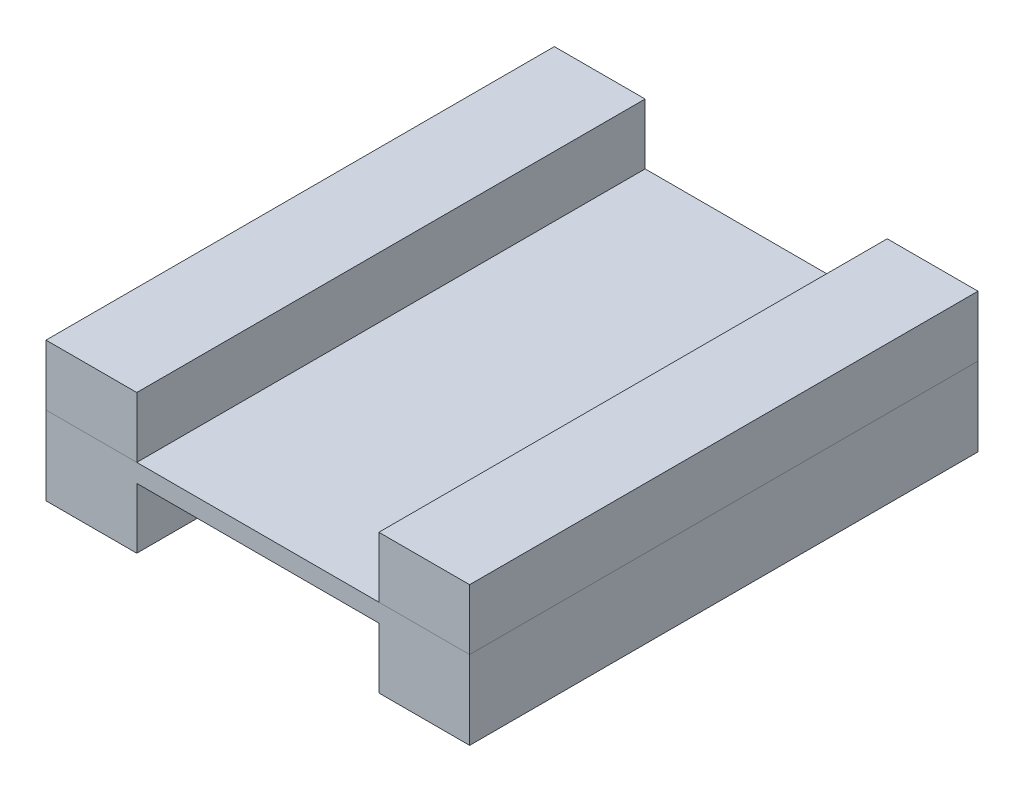
ISO-10303-21;
HEADER;
FILE_DESCRIPTION(('STEP AP214'),'2;1');
FILE_NAME('part.step','',(''),(''),'','','');
FILE_SCHEMA(('AUTOMOTIVE_DESIGN { 1 0 10303 214 1 1 1 1 }'));
ENDSEC;
DATA;
#1=APPLICATION_CONTEXT('core data for automotive mechanical design processes');
#2=APPLICATION_PROTOCOL_DEFINITION('international standard','automotive_design',2000,#1);
#3=PRODUCT_CONTEXT('',#1,'mechanical');
#4=PRODUCT('Part','Part','',(#3));
#5=PRODUCT_RELATED_PRODUCT_CATEGORY('part','',(#4));
#6=PRODUCT_DEFINITION_FORMATION('','',#4);
#7=PRODUCT_DEFINITION_CONTEXT('part definition',#1,'design');
#8=PRODUCT_DEFINITION('design','',#6,#7);
#9=PRODUCT_DEFINITION_SHAPE('','',#8);
#10=(LENGTH_UNIT() NAMED_UNIT(*) SI_UNIT(.MILLI.,.METRE.));
#11=(NAMED_UNIT(*) PLANE_ANGLE_UNIT() SI_UNIT($,.RADIAN.));
#12=(NAMED_UNIT(*) SI_UNIT($,.STERADIAN.) SOLID_ANGLE_UNIT());
#13=UNCERTAINTY_MEASURE_WITH_UNIT(LENGTH_MEASURE(1.E-05),#10,'distance_accuracy_value','');
#14=(GEOMETRIC_REPRESENTATION_CONTEXT(3) GLOBAL_UNCERTAINTY_ASSIGNED_CONTEXT((#13)) GLOBAL_UNIT_ASSIGNED_CONTEXT((#10,
#11,#12)) REPRESENTATION_CONTEXT('',''));
#15=CARTESIAN_POINT('',(0.,0.,0.));
#16=DIRECTION('',(0.,0.,1.));
#17=DIRECTION('',(1.,0.,0.));
#18=AXIS2_PLACEMENT_3D('',#15,#16,#17);
#19=CARTESIAN_POINT('',(35.,13.,-42.));
#20=DIRECTION('',(-1.,0.,0.));
#21=DIRECTION('',(0.,0.,1.));
#22=AXIS2_PLACEMENT_3D('',#19,#20,#21);
#23=PLANE('',#22);
#24=DIRECTION('',(0.,0.,-1.));
#25=VECTOR('',#24,1.);
#26=CARTESIAN_POINT('',(35.,3.,-42.));
#27=LINE('',#26,#25);
#28=CARTESIAN_POINT('',(35.,3.,42.));
#29=VERTEX_POINT('',#28);
#30=CARTESIAN_POINT('',(35.,3.,-42.));
#31=VERTEX_POINT('',#30);
#32=EDGE_CURVE('E12',#29,#31,#27,.T.);
#33=ORIENTED_EDGE('',*,*,#32,.T.);
#34=DIRECTION('',(0.,-1.,0.));
#35=VECTOR('',#34,1.);
#36=CARTESIAN_POINT('',(35.,13.,-42.));
#37=LINE('',#36,#35);
#38=CARTESIAN_POINT('',(35.,13.,-42.));
#39=VERTEX_POINT('',#38);
#40=EDGE_CURVE('E133',#39,#31,#37,.T.);
#41=ORIENTED_EDGE('',*,*,#40,.F.);
#42=DIRECTION('',(0.,0.,-1.));
#43=VECTOR('',#42,1.);
#44=CARTESIAN_POINT('',(35.,13.,-42.));
#45=LINE('',#44,#43);
#46=CARTESIAN_POINT('',(35.,13.,42.));
#47=VERTEX_POINT('',#46);
#48=EDGE_CURVE('E66',#47,#39,#45,.T.);
#49=ORIENTED_EDGE('',*,*,#48,.F.);
#50=DIRECTION('',(0.,-1.,0.));
#51=VECTOR('',#50,1.);
#52=CARTESIAN_POINT('',(35.,13.,42.));
#53=LINE('',#52,#51);
#54=EDGE_CURVE('E121',#47,#29,#53,.T.);
#55=ORIENTED_EDGE('',*,*,#54,.T.);
#56=EDGE_LOOP('',(#33,#41,#49,#55));
#57=FACE_BOUND('',#56,.T.);
#58=ADVANCED_FACE('F62',(#57),#23,.F.);
#59=CARTESIAN_POINT('',(35.,13.,-42.));
#60=DIRECTION('',(0.,0.,1.));
#61=DIRECTION('',(1.,0.,0.));
#62=AXIS2_PLACEMENT_3D('',#59,#60,#61);
#63=PLANE('',#62);
#64=DIRECTION('',(-1.,0.,0.));
#65=VECTOR('',#64,1.);
#66=CARTESIAN_POINT('',(35.,3.,-42.));
#67=LINE('',#66,#65);
#68=CARTESIAN_POINT('',(20.,3.,-42.));
#69=VERTEX_POINT('',#68);
#70=EDGE_CURVE('E72',#31,#69,#67,.T.);
#71=ORIENTED_EDGE('',*,*,#70,.T.);
#72=DIRECTION('',(0.,-1.,0.));
#73=VECTOR('',#72,1.);
#74=CARTESIAN_POINT('',(20.,13.,-42.));
#75=LINE('',#74,#73);
#76=CARTESIAN_POINT('',(20.,13.,-42.));
#77=VERTEX_POINT('',#76);
#78=EDGE_CURVE('E117',#77,#69,#75,.T.);
#79=ORIENTED_EDGE('',*,*,#78,.F.);
#80=DIRECTION('',(-1.,0.,0.));
#81=VECTOR('',#80,1.);
#82=CARTESIAN_POINT('',(35.,13.,-42.));
#83=LINE('',#82,#81);
#84=EDGE_CURVE('E96',#39,#77,#83,.T.);
#85=ORIENTED_EDGE('',*,*,#84,.F.);
#86=ORIENTED_EDGE('',*,*,#40,.T.);
#87=EDGE_LOOP('',(#71,#79,#85,#86));
#88=FACE_BOUND('',#87,.T.);
#89=ADVANCED_FACE('F136',(#88),#63,.F.);
#90=CARTESIAN_POINT('',(20.,13.,-42.));
#91=DIRECTION('',(1.,0.,0.));
#92=DIRECTION('',(0.,0.,-1.));
#93=AXIS2_PLACEMENT_3D('',#90,#91,#92);
#94=PLANE('',#93);
#95=DIRECTION('',(0.,0.,1.));
#96=VECTOR('',#95,1.);
#97=CARTESIAN_POINT('',(20.,3.,-42.));
#98=LINE('',#97,#96);
#99=CARTESIAN_POINT('',(20.,3.,42.));
#100=VERTEX_POINT('',#99);
#101=EDGE_CURVE('E112',#69,#100,#98,.T.);
#102=ORIENTED_EDGE('',*,*,#101,.T.);
#103=DIRECTION('',(0.,-1.,0.));
#104=VECTOR('',#103,1.);
#105=CARTESIAN_POINT('',(20.,13.,42.));
#106=LINE('',#105,#104);
#107=CARTESIAN_POINT('',(20.,13.,42.));
#108=VERTEX_POINT('',#107);
#109=EDGE_CURVE('E115',#108,#100,#106,.T.);
#110=ORIENTED_EDGE('',*,*,#109,.F.);
#111=DIRECTION('',(0.,0.,1.));
#112=VECTOR('',#111,1.);
#113=CARTESIAN_POINT('',(20.,13.,-42.));
#114=LINE('',#113,#112);
#115=EDGE_CURVE('E129',#77,#108,#114,.T.);
#116=ORIENTED_EDGE('',*,*,#115,.F.);
#117=ORIENTED_EDGE('',*,*,#78,.T.);
#118=EDGE_LOOP('',(#102,#110,#116,#117));
#119=FACE_BOUND('',#118,.T.);
#120=ADVANCED_FACE('F113',(#119),#94,.F.);
#121=CARTESIAN_POINT('',(35.,13.,42.));
#122=DIRECTION('',(0.,0.,-1.));
#123=DIRECTION('',(-1.,0.,0.));
#124=AXIS2_PLACEMENT_3D('',#121,#122,#123);
#125=PLANE('',#124);
#126=DIRECTION('',(1.,0.,0.));
#127=VECTOR('',#126,1.);
#128=CARTESIAN_POINT('',(35.,3.,42.));
#129=LINE('',#128,#127);
#130=EDGE_CURVE('E106',#100,#29,#129,.T.);
#131=ORIENTED_EDGE('',*,*,#130,.T.);
#132=ORIENTED_EDGE('',*,*,#54,.F.);
#133=DIRECTION('',(1.,0.,0.));
#134=VECTOR('',#133,1.);
#135=CARTESIAN_POINT('',(35.,13.,42.));
#136=LINE('',#135,#134);
#137=EDGE_CURVE('E120',#108,#47,#136,.T.);
#138=ORIENTED_EDGE('',*,*,#137,.F.);
#139=ORIENTED_EDGE('',*,*,#109,.T.);
#140=EDGE_LOOP('',(#131,#132,#138,#139));
#141=FACE_BOUND('',#140,.T.);
#142=ADVANCED_FACE('F119',(#141),#125,.F.);
#143=CARTESIAN_POINT('',(0.,13.,0.));
#144=DIRECTION('',(0.,-1.,0.));
#145=DIRECTION('',(0.,0.,-1.));
#146=AXIS2_PLACEMENT_3D('',#143,#144,#145);
#147=PLANE('',#146);
#148=ORIENTED_EDGE('',*,*,#48,.T.);
#149=ORIENTED_EDGE('',*,*,#84,.T.);
#150=ORIENTED_EDGE('',*,*,#115,.T.);
#151=ORIENTED_EDGE('',*,*,#137,.T.);
#152=EDGE_LOOP('',(#148,#149,#150,#151));
#153=FACE_BOUND('',#152,.T.);
#154=ADVANCED_FACE('F64',(#153),#147,.F.);
#155=CARTESIAN_POINT('',(0.,3.,0.));
#156=DIRECTION('',(0.,-1.,0.));
#157=DIRECTION('',(0.,0.,-1.));
#158=AXIS2_PLACEMENT_3D('',#155,#156,#157);
#159=PLANE('',#158);
#160=ORIENTED_EDGE('',*,*,#32,.F.);
#161=ORIENTED_EDGE('',*,*,#130,.F.);
#162=ORIENTED_EDGE('',*,*,#101,.F.);
#163=ORIENTED_EDGE('',*,*,#70,.F.);
#164=EDGE_LOOP('',(#160,#161,#162,#163));
#165=FACE_BOUND('',#164,.T.);
#166=ADVANCED_FACE('F123',(#165),#159,.T.);
#167=CLOSED_SHELL('',(#58,#89,#120,#142,#154,#166));
#168=MANIFOLD_SOLID_BREP('B2',#167);
#169=CARTESIAN_POINT('',(-35.,13.,-42.));
#170=DIRECTION('',(1.,0.,0.));
#171=DIRECTION('',(0.,0.,-1.));
#172=AXIS2_PLACEMENT_3D('',#169,#170,#171);
#173=PLANE('',#172);
#174=DIRECTION('',(0.,0.,1.));
#175=VECTOR('',#174,1.);
#176=CARTESIAN_POINT('',(-35.,3.,-42.));
#177=LINE('',#176,#175);
#178=CARTESIAN_POINT('',(-35.,3.,-42.));
#179=VERTEX_POINT('',#178);
#180=CARTESIAN_POINT('',(-35.,3.,42.));
#181=VERTEX_POINT('',#180);
#182=EDGE_CURVE('E258',#179,#181,#177,.T.);
#183=ORIENTED_EDGE('',*,*,#182,.T.);
#184=DIRECTION('',(0.,-1.,0.));
#185=VECTOR('',#184,1.);
#186=CARTESIAN_POINT('',(-35.,13.,42.));
#187=LINE('',#186,#185);
#188=CARTESIAN_POINT('',(-35.,13.,42.));
#189=VERTEX_POINT('',#188);
#190=EDGE_CURVE('E60',#189,#181,#187,.T.);
#191=ORIENTED_EDGE('',*,*,#190,.F.);
#192=DIRECTION('',(0.,0.,1.));
#193=VECTOR('',#192,1.);
#194=CARTESIAN_POINT('',(-35.,13.,-42.));
#195=LINE('',#194,#193);
#196=CARTESIAN_POINT('',(-35.,13.,-42.));
#197=VERTEX_POINT('',#196);
#198=EDGE_CURVE('E246',#197,#189,#195,.T.);
#199=ORIENTED_EDGE('',*,*,#198,.F.);
#200=DIRECTION('',(0.,-1.,0.));
#201=VECTOR('',#200,1.);
#202=CARTESIAN_POINT('',(-35.,13.,-42.));
#203=LINE('',#202,#201);
#204=EDGE_CURVE('E254',#197,#179,#203,.T.);
#205=ORIENTED_EDGE('',*,*,#204,.T.);
#206=EDGE_LOOP('',(#183,#191,#199,#205));
#207=FACE_BOUND('',#206,.T.);
#208=ADVANCED_FACE('F195',(#207),#173,.F.);
#209=CARTESIAN_POINT('',(-35.,13.,42.));
#210=DIRECTION('',(0.,0.,-1.));
#211=DIRECTION('',(-1.,0.,0.));
#212=AXIS2_PLACEMENT_3D('',#209,#210,#211);
#213=PLANE('',#212);
#214=DIRECTION('',(1.,0.,0.));
#215=VECTOR('',#214,1.);
#216=CARTESIAN_POINT('',(-35.,3.,42.));
#217=LINE('',#216,#215);
#218=CARTESIAN_POINT('',(-20.,3.,42.));
#219=VERTEX_POINT('',#218);
#220=EDGE_CURVE('E250',#181,#219,#217,.T.);
#221=ORIENTED_EDGE('',*,*,#220,.T.);
#222=DIRECTION('',(0.,-1.,0.));
#223=VECTOR('',#222,1.);
#224=CARTESIAN_POINT('',(-20.,13.,42.));
#225=LINE('',#224,#223);
#226=CARTESIAN_POINT('',(-20.,13.,42.));
#227=VERTEX_POINT('',#226);
#228=EDGE_CURVE('E203',#227,#219,#225,.T.);
#229=ORIENTED_EDGE('',*,*,#228,.F.);
#230=DIRECTION('',(1.,0.,0.));
#231=VECTOR('',#230,1.);
#232=CARTESIAN_POINT('',(-35.,13.,42.));
#233=LINE('',#232,#231);
#234=EDGE_CURVE('E241',#189,#227,#233,.T.);
#235=ORIENTED_EDGE('',*,*,#234,.F.);
#236=ORIENTED_EDGE('',*,*,#190,.T.);
#237=EDGE_LOOP('',(#221,#229,#235,#236));
#238=FACE_BOUND('',#237,.T.);
#239=ADVANCED_FACE('F249',(#238),#213,.F.);
#240=CARTESIAN_POINT('',(-20.,13.,-42.));
#241=DIRECTION('',(-1.,0.,0.));
#242=DIRECTION('',(0.,0.,1.));
#243=AXIS2_PLACEMENT_3D('',#240,#241,#242);
#244=PLANE('',#243);
#245=DIRECTION('',(0.,0.,-1.));
#246=VECTOR('',#245,1.);
#247=CARTESIAN_POINT('',(-20.,3.,-42.));
#248=LINE('',#247,#246);
#249=CARTESIAN_POINT('',(-20.,3.,-42.));
#250=VERTEX_POINT('',#249);
#251=EDGE_CURVE('E228',#219,#250,#248,.T.);
#252=ORIENTED_EDGE('',*,*,#251,.T.);
#253=DIRECTION('',(0.,-1.,0.));
#254=VECTOR('',#253,1.);
#255=CARTESIAN_POINT('',(-20.,13.,-42.));
#256=LINE('',#255,#254);
#257=CARTESIAN_POINT('',(-20.,13.,-42.));
#258=VERTEX_POINT('',#257);
#259=EDGE_CURVE('E251',#258,#250,#256,.T.);
#260=ORIENTED_EDGE('',*,*,#259,.F.);
#261=DIRECTION('',(0.,0.,-1.));
#262=VECTOR('',#261,1.);
#263=CARTESIAN_POINT('',(-20.,13.,-42.));
#264=LINE('',#263,#262);
#265=EDGE_CURVE('E244',#227,#258,#264,.T.);
#266=ORIENTED_EDGE('',*,*,#265,.F.);
#267=ORIENTED_EDGE('',*,*,#228,.T.);
#268=EDGE_LOOP('',(#252,#260,#266,#267));
#269=FACE_BOUND('',#268,.T.);
#270=ADVANCED_FACE('F252',(#269),#244,.F.);
#271=CARTESIAN_POINT('',(-35.,13.,-42.));
#272=DIRECTION('',(0.,0.,1.));
#273=DIRECTION('',(1.,0.,0.));
#274=AXIS2_PLACEMENT_3D('',#271,#272,#273);
#275=PLANE('',#274);
#276=DIRECTION('',(-1.,0.,0.));
#277=VECTOR('',#276,1.);
#278=CARTESIAN_POINT('',(-35.,3.,-42.));
#279=LINE('',#278,#277);
#280=EDGE_CURVE('E234',#250,#179,#279,.T.);
#281=ORIENTED_EDGE('',*,*,#280,.T.);
#282=ORIENTED_EDGE('',*,*,#204,.F.);
#283=DIRECTION('',(-1.,0.,0.));
#284=VECTOR('',#283,1.);
#285=CARTESIAN_POINT('',(-35.,13.,-42.));
#286=LINE('',#285,#284);
#287=EDGE_CURVE('E211',#258,#197,#286,.T.);
#288=ORIENTED_EDGE('',*,*,#287,.F.);
#289=ORIENTED_EDGE('',*,*,#259,.T.);
#290=EDGE_LOOP('',(#281,#282,#288,#289));
#291=FACE_BOUND('',#290,.T.);
#292=ADVANCED_FACE('F265',(#291),#275,.F.);
#293=CARTESIAN_POINT('',(0.,13.,0.));
#294=DIRECTION('',(0.,1.,0.));
#295=DIRECTION('',(0.,0.,1.));
#296=AXIS2_PLACEMENT_3D('',#293,#294,#295);
#297=PLANE('',#296);
#298=ORIENTED_EDGE('',*,*,#198,.T.);
#299=ORIENTED_EDGE('',*,*,#234,.T.);
#300=ORIENTED_EDGE('',*,*,#265,.T.);
#301=ORIENTED_EDGE('',*,*,#287,.T.);
#302=EDGE_LOOP('',(#298,#299,#300,#301));
#303=FACE_BOUND('',#302,.T.);
#304=ADVANCED_FACE('F242',(#303),#297,.T.);
#305=CARTESIAN_POINT('',(0.,3.,0.));
#306=DIRECTION('',(0.,1.,0.));
#307=DIRECTION('',(0.,0.,1.));
#308=AXIS2_PLACEMENT_3D('',#305,#306,#307);
#309=PLANE('',#308);
#310=ORIENTED_EDGE('',*,*,#182,.F.);
#311=ORIENTED_EDGE('',*,*,#280,.F.);
#312=ORIENTED_EDGE('',*,*,#251,.F.);
#313=ORIENTED_EDGE('',*,*,#220,.F.);
#314=EDGE_LOOP('',(#310,#311,#312,#313));
#315=FACE_BOUND('',#314,.T.);
#316=ADVANCED_FACE('F268',(#315),#309,.F.);
#317=CLOSED_SHELL('',(#208,#239,#270,#292,#304,#316));
#318=MANIFOLD_SOLID_BREP('B6',#317);
#319=CARTESIAN_POINT('',(0.,0.,0.));
#320=DIRECTION('',(0.,1.,0.));
#321=DIRECTION('',(0.,0.,1.));
#322=AXIS2_PLACEMENT_3D('',#319,#320,#321);
#323=PLANE('',#322);
#324=DIRECTION('',(0.,0.,-1.));
#325=VECTOR('',#324,1.);
#326=CARTESIAN_POINT('',(-20.,0.,-42.));
#327=LINE('',#326,#325);
#328=CARTESIAN_POINT('',(-20.,0.,42.));
#329=VERTEX_POINT('',#328);
#330=CARTESIAN_POINT('',(-20.,0.,-42.));
#331=VERTEX_POINT('',#330);
#332=EDGE_CURVE('E402',#329,#331,#327,.T.);
#333=ORIENTED_EDGE('',*,*,#332,.T.);
#334=DIRECTION('',(-1.,0.,0.));
#335=VECTOR('',#334,1.);
#336=CARTESIAN_POINT('',(35.,0.,-42.));
#337=LINE('',#336,#335);
#338=CARTESIAN_POINT('',(20.,0.,-42.));
#339=VERTEX_POINT('',#338);
#340=EDGE_CURVE('E453',#339,#331,#337,.T.);
#341=ORIENTED_EDGE('',*,*,#340,.F.);
#342=DIRECTION('',(0.,0.,1.));
#343=VECTOR('',#342,1.);
#344=CARTESIAN_POINT('',(20.,0.,-42.));
#345=LINE('',#344,#343);
#346=CARTESIAN_POINT('',(20.,0.,42.));
#347=VERTEX_POINT('',#346);
#348=EDGE_CURVE('E435',#339,#347,#345,.T.);
#349=ORIENTED_EDGE('',*,*,#348,.T.);
#350=DIRECTION('',(1.,0.,0.));
#351=VECTOR('',#350,1.);
#352=CARTESIAN_POINT('',(35.,0.,42.));
#353=LINE('',#352,#351);
#354=EDGE_CURVE('E335',#329,#347,#353,.T.);
#355=ORIENTED_EDGE('',*,*,#354,.F.);
#356=EDGE_LOOP('',(#333,#341,#349,#355));
#357=FACE_BOUND('',#356,.T.);
#358=ADVANCED_FACE('F319',(#357),#323,.F.);
#359=CARTESIAN_POINT('',(-35.,3.,42.));
#360=DIRECTION('',(1.,0.,0.));
#361=DIRECTION('',(0.,0.,-1.));
#362=AXIS2_PLACEMENT_3D('',#359,#360,#361);
#363=PLANE('',#362);
#364=DIRECTION('',(0.,-1.,0.));
#365=VECTOR('',#364,1.);
#366=CARTESIAN_POINT('',(-35.,3.,-42.));
#367=LINE('',#366,#365);
#368=CARTESIAN_POINT('',(-35.,3.,-42.));
#369=VERTEX_POINT('',#368);
#370=CARTESIAN_POINT('',(-35.,-10.,-42.));
#371=VERTEX_POINT('',#370);
#372=EDGE_CURVE('E405',#369,#371,#367,.T.);
#373=ORIENTED_EDGE('',*,*,#372,.T.);
#374=DIRECTION('',(0.,0.,1.));
#375=VECTOR('',#374,1.);
#376=CARTESIAN_POINT('',(-35.,-10.,-42.));
#377=LINE('',#376,#375);
#378=CARTESIAN_POINT('',(-35.,-10.,42.));
#379=VERTEX_POINT('',#378);
#380=EDGE_CURVE('E397',#371,#379,#377,.T.);
#381=ORIENTED_EDGE('',*,*,#380,.T.);
#382=DIRECTION('',(0.,-1.,0.));
#383=VECTOR('',#382,1.);
#384=CARTESIAN_POINT('',(-35.,3.,42.));
#385=LINE('',#384,#383);
#386=CARTESIAN_POINT('',(-35.,3.,42.));
#387=VERTEX_POINT('',#386);
#388=EDGE_CURVE('E193',#387,#379,#385,.T.);
#389=ORIENTED_EDGE('',*,*,#388,.F.);
#390=DIRECTION('',(0.,0.,1.));
#391=VECTOR('',#390,1.);
#392=CARTESIAN_POINT('',(-35.,3.,42.));
#393=LINE('',#392,#391);
#394=EDGE_CURVE('E450',#369,#387,#393,.T.);
#395=ORIENTED_EDGE('',*,*,#394,.F.);
#396=EDGE_LOOP('',(#373,#381,#389,#395));
#397=FACE_BOUND('',#396,.T.);
#398=ADVANCED_FACE('F321',(#397),#363,.F.);
#399=CARTESIAN_POINT('',(35.,3.,42.));
#400=DIRECTION('',(0.,0.,-1.));
#401=DIRECTION('',(-1.,0.,0.));
#402=AXIS2_PLACEMENT_3D('',#399,#400,#401);
#403=PLANE('',#402);
#404=ORIENTED_EDGE('',*,*,#388,.T.);
#405=DIRECTION('',(1.,0.,0.));
#406=VECTOR('',#405,1.);
#407=CARTESIAN_POINT('',(-35.,-10.,42.));
#408=LINE('',#407,#406);
#409=CARTESIAN_POINT('',(-20.,-10.,42.));
#410=VERTEX_POINT('',#409);
#411=EDGE_CURVE('E388',#379,#410,#408,.T.);
#412=ORIENTED_EDGE('',*,*,#411,.T.);
#413=DIRECTION('',(0.,1.,0.));
#414=VECTOR('',#413,1.);
#415=CARTESIAN_POINT('',(-20.,-10.,42.));
#416=LINE('',#415,#414);
#417=EDGE_CURVE('E403',#410,#329,#416,.T.);
#418=ORIENTED_EDGE('',*,*,#417,.T.);
#419=ORIENTED_EDGE('',*,*,#354,.T.);
#420=DIRECTION('',(0.,1.,0.));
#421=VECTOR('',#420,1.);
#422=CARTESIAN_POINT('',(20.,-10.,42.));
#423=LINE('',#422,#421);
#424=CARTESIAN_POINT('',(20.,-10.,42.));
#425=VERTEX_POINT('',#424);
#426=EDGE_CURVE('E439',#425,#347,#423,.T.);
#427=ORIENTED_EDGE('',*,*,#426,.F.);
#428=DIRECTION('',(1.,0.,0.));
#429=VECTOR('',#428,1.);
#430=CARTESIAN_POINT('',(35.,-10.,42.));
#431=LINE('',#430,#429);
#432=CARTESIAN_POINT('',(35.,-10.,42.));
#433=VERTEX_POINT('',#432);
#434=EDGE_CURVE('E446',#425,#433,#431,.T.);
#435=ORIENTED_EDGE('',*,*,#434,.T.);
#436=DIRECTION('',(0.,-1.,0.));
#437=VECTOR('',#436,1.);
#438=CARTESIAN_POINT('',(35.,3.,42.));
#439=LINE('',#438,#437);
#440=CARTESIAN_POINT('',(35.,3.,42.));
#441=VERTEX_POINT('',#440);
#442=EDGE_CURVE('E328',#441,#433,#439,.T.);
#443=ORIENTED_EDGE('',*,*,#442,.F.);
#444=DIRECTION('',(1.,0.,0.));
#445=VECTOR('',#444,1.);
#446=CARTESIAN_POINT('',(35.,3.,42.));
#447=LINE('',#446,#445);
#448=EDGE_CURVE('E390',#387,#441,#447,.T.);
#449=ORIENTED_EDGE('',*,*,#448,.F.);
#450=EDGE_LOOP('',(#404,#412,#418,#419,#427,#435,#443,#449));
#451=FACE_BOUND('',#450,.T.);
#452=ADVANCED_FACE('F387',(#451),#403,.F.);
#453=CARTESIAN_POINT('',(35.,3.,42.));
#454=DIRECTION('',(-1.,0.,0.));
#455=DIRECTION('',(0.,0.,1.));
#456=AXIS2_PLACEMENT_3D('',#453,#454,#455);
#457=PLANE('',#456);
#458=ORIENTED_EDGE('',*,*,#442,.T.);
#459=DIRECTION('',(0.,0.,-1.));
#460=VECTOR('',#459,1.);
#461=CARTESIAN_POINT('',(35.,-10.,-42.));
#462=LINE('',#461,#460);
#463=CARTESIAN_POINT('',(35.,-10.,-42.));
#464=VERTEX_POINT('',#463);
#465=EDGE_CURVE('E423',#433,#464,#462,.T.);
#466=ORIENTED_EDGE('',*,*,#465,.T.);
#467=DIRECTION('',(0.,-1.,0.));
#468=VECTOR('',#467,1.);
#469=CARTESIAN_POINT('',(35.,3.,-42.));
#470=LINE('',#469,#468);
#471=CARTESIAN_POINT('',(35.,3.,-42.));
#472=VERTEX_POINT('',#471);
#473=EDGE_CURVE('E468',#472,#464,#470,.T.);
#474=ORIENTED_EDGE('',*,*,#473,.F.);
#475=DIRECTION('',(0.,0.,-1.));
#476=VECTOR('',#475,1.);
#477=CARTESIAN_POINT('',(35.,3.,42.));
#478=LINE('',#477,#476);
#479=EDGE_CURVE('E456',#441,#472,#478,.T.);
#480=ORIENTED_EDGE('',*,*,#479,.F.);
#481=EDGE_LOOP('',(#458,#466,#474,#480));
#482=FACE_BOUND('',#481,.T.);
#483=ADVANCED_FACE('F473',(#482),#457,.F.);
#484=CARTESIAN_POINT('',(35.,3.,-42.));
#485=DIRECTION('',(0.,0.,1.));
#486=DIRECTION('',(1.,0.,0.));
#487=AXIS2_PLACEMENT_3D('',#484,#485,#486);
#488=PLANE('',#487);
#489=ORIENTED_EDGE('',*,*,#473,.T.);
#490=DIRECTION('',(-1.,0.,0.));
#491=VECTOR('',#490,1.);
#492=CARTESIAN_POINT('',(35.,-10.,-42.));
#493=LINE('',#492,#491);
#494=CARTESIAN_POINT('',(20.,-10.,-42.));
#495=VERTEX_POINT('',#494);
#496=EDGE_CURVE('E431',#464,#495,#493,.T.);
#497=ORIENTED_EDGE('',*,*,#496,.T.);
#498=DIRECTION('',(0.,1.,0.));
#499=VECTOR('',#498,1.);
#500=CARTESIAN_POINT('',(20.,-10.,-42.));
#501=LINE('',#500,#499);
#502=EDGE_CURVE('E427',#495,#339,#501,.T.);
#503=ORIENTED_EDGE('',*,*,#502,.T.);
#504=ORIENTED_EDGE('',*,*,#340,.T.);
#505=DIRECTION('',(0.,1.,0.));
#506=VECTOR('',#505,1.);
#507=CARTESIAN_POINT('',(-20.,-10.,-42.));
#508=LINE('',#507,#506);
#509=CARTESIAN_POINT('',(-20.,-10.,-42.));
#510=VERTEX_POINT('',#509);
#511=EDGE_CURVE('E415',#510,#331,#508,.T.);
#512=ORIENTED_EDGE('',*,*,#511,.F.);
#513=DIRECTION('',(-1.,0.,0.));
#514=VECTOR('',#513,1.);
#515=CARTESIAN_POINT('',(-35.,-10.,-42.));
#516=LINE('',#515,#514);
#517=EDGE_CURVE('E420',#510,#371,#516,.T.);
#518=ORIENTED_EDGE('',*,*,#517,.T.);
#519=ORIENTED_EDGE('',*,*,#372,.F.);
#520=DIRECTION('',(-1.,0.,0.));
#521=VECTOR('',#520,1.);
#522=CARTESIAN_POINT('',(35.,3.,-42.));
#523=LINE('',#522,#521);
#524=EDGE_CURVE('E343',#472,#369,#523,.T.);
#525=ORIENTED_EDGE('',*,*,#524,.F.);
#526=EDGE_LOOP('',(#489,#497,#503,#504,#512,#518,#519,#525));
#527=FACE_BOUND('',#526,.T.);
#528=ADVANCED_FACE('F481',(#527),#488,.F.);
#529=CARTESIAN_POINT('',(0.,3.,0.));
#530=DIRECTION('',(0.,1.,0.));
#531=DIRECTION('',(0.,0.,1.));
#532=AXIS2_PLACEMENT_3D('',#529,#530,#531);
#533=PLANE('',#532);
#534=ORIENTED_EDGE('',*,*,#394,.T.);
#535=ORIENTED_EDGE('',*,*,#448,.T.);
#536=ORIENTED_EDGE('',*,*,#479,.T.);
#537=ORIENTED_EDGE('',*,*,#524,.T.);
#538=EDGE_LOOP('',(#534,#535,#536,#537));
#539=FACE_BOUND('',#538,.T.);
#540=ADVANCED_FACE('F484',(#539),#533,.T.);
#541=CARTESIAN_POINT('',(20.,-10.,-42.));
#542=DIRECTION('',(1.,0.,0.));
#543=DIRECTION('',(0.,0.,-1.));
#544=AXIS2_PLACEMENT_3D('',#541,#542,#543);
#545=PLANE('',#544);
#546=ORIENTED_EDGE('',*,*,#348,.F.);
#547=ORIENTED_EDGE('',*,*,#502,.F.);
#548=DIRECTION('',(0.,0.,1.));
#549=VECTOR('',#548,1.);
#550=CARTESIAN_POINT('',(20.,-10.,-42.));
#551=LINE('',#550,#549);
#552=EDGE_CURVE('E442',#495,#425,#551,.T.);
#553=ORIENTED_EDGE('',*,*,#552,.T.);
#554=ORIENTED_EDGE('',*,*,#426,.T.);
#555=EDGE_LOOP('',(#546,#547,#553,#554));
#556=FACE_BOUND('',#555,.T.);
#557=ADVANCED_FACE('F486',(#556),#545,.F.);
#558=CARTESIAN_POINT('',(0.,-10.,0.));
#559=DIRECTION('',(0.,1.,0.));
#560=DIRECTION('',(0.,0.,-1.));
#561=AXIS2_PLACEMENT_3D('',#558,#559,#560);
#562=PLANE('',#561);
#563=ORIENTED_EDGE('',*,*,#465,.F.);
#564=ORIENTED_EDGE('',*,*,#434,.F.);
#565=ORIENTED_EDGE('',*,*,#552,.F.);
#566=ORIENTED_EDGE('',*,*,#496,.F.);
#567=EDGE_LOOP('',(#563,#564,#565,#566));
#568=FACE_BOUND('',#567,.T.);
#569=ADVANCED_FACE('F478',(#568),#562,.F.);
#570=CARTESIAN_POINT('',(-20.,-10.,-42.));
#571=DIRECTION('',(-1.,0.,0.));
#572=DIRECTION('',(0.,0.,1.));
#573=AXIS2_PLACEMENT_3D('',#570,#571,#572);
#574=PLANE('',#573);
#575=ORIENTED_EDGE('',*,*,#332,.F.);
#576=ORIENTED_EDGE('',*,*,#417,.F.);
#577=DIRECTION('',(0.,0.,-1.));
#578=VECTOR('',#577,1.);
#579=CARTESIAN_POINT('',(-20.,-10.,-42.));
#580=LINE('',#579,#578);
#581=EDGE_CURVE('E399',#410,#510,#580,.T.);
#582=ORIENTED_EDGE('',*,*,#581,.T.);
#583=ORIENTED_EDGE('',*,*,#511,.T.);
#584=EDGE_LOOP('',(#575,#576,#582,#583));
#585=FACE_BOUND('',#584,.T.);
#586=ADVANCED_FACE('F537',(#585),#574,.F.);
#587=CARTESIAN_POINT('',(0.,-10.,0.));
#588=DIRECTION('',(0.,-1.,0.));
#589=DIRECTION('',(0.,0.,1.));
#590=AXIS2_PLACEMENT_3D('',#587,#588,#589);
#591=PLANE('',#590);
#592=ORIENTED_EDGE('',*,*,#380,.F.);
#593=ORIENTED_EDGE('',*,*,#517,.F.);
#594=ORIENTED_EDGE('',*,*,#581,.F.);
#595=ORIENTED_EDGE('',*,*,#411,.F.);
#596=EDGE_LOOP('',(#592,#593,#594,#595));
#597=FACE_BOUND('',#596,.T.);
#598=ADVANCED_FACE('F396',(#597),#591,.T.);
#599=CLOSED_SHELL('',(#358,#398,#452,#483,#528,#540,#557,#569,#586,#598));
#600=MANIFOLD_SOLID_BREP('B54',#599);
#601=ADVANCED_BREP_SHAPE_REPRESENTATION('',(#18,#168,#318,#600),#14);
#602=SHAPE_DEFINITION_REPRESENTATION(#9,#601);
ENDSEC;
END-ISO-10303-21;
